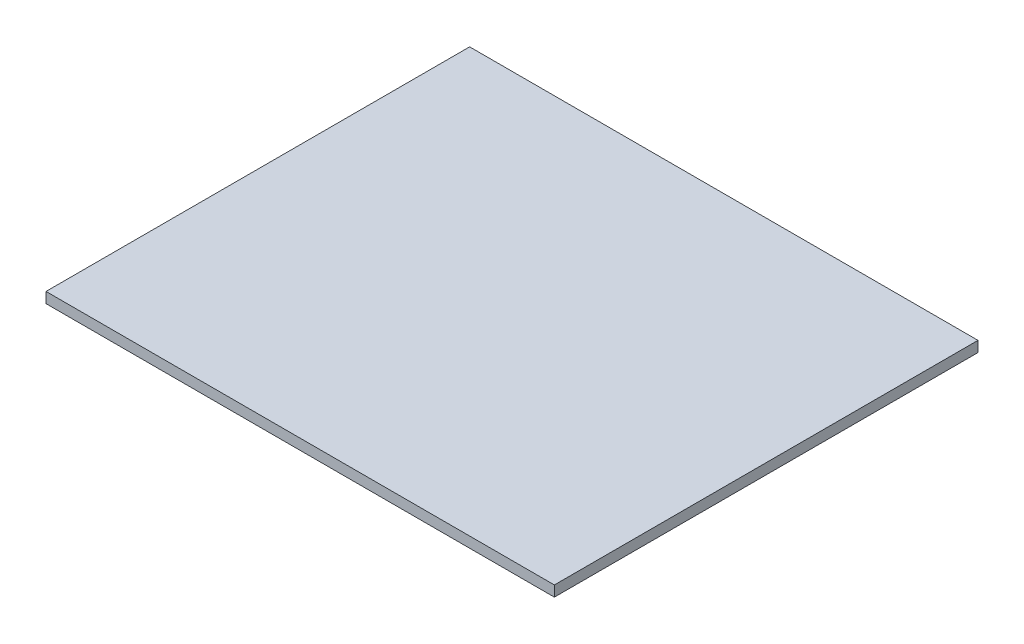
ISO-10303-21;
HEADER;
FILE_DESCRIPTION(('STEP AP214'),'2;1');
FILE_NAME('part.step','',(''),(''),'','','');
FILE_SCHEMA(('AUTOMOTIVE_DESIGN { 1 0 10303 214 1 1 1 1 }'));
ENDSEC;
DATA;
#1=APPLICATION_CONTEXT('core data for automotive mechanical design processes');
#2=APPLICATION_PROTOCOL_DEFINITION('international standard','automotive_design',2000,#1);
#3=PRODUCT_CONTEXT('',#1,'mechanical');
#4=PRODUCT('Part','Part','',(#3));
#5=PRODUCT_RELATED_PRODUCT_CATEGORY('part','',(#4));
#6=PRODUCT_DEFINITION_FORMATION('','',#4);
#7=PRODUCT_DEFINITION_CONTEXT('part definition',#1,'design');
#8=PRODUCT_DEFINITION('design','',#6,#7);
#9=PRODUCT_DEFINITION_SHAPE('','',#8);
#10=(LENGTH_UNIT() NAMED_UNIT(*) SI_UNIT(.MILLI.,.METRE.));
#11=(NAMED_UNIT(*) PLANE_ANGLE_UNIT() SI_UNIT($,.RADIAN.));
#12=(NAMED_UNIT(*) SI_UNIT($,.STERADIAN.) SOLID_ANGLE_UNIT());
#13=UNCERTAINTY_MEASURE_WITH_UNIT(LENGTH_MEASURE(1.E-05),#10,'distance_accuracy_value','');
#14=(GEOMETRIC_REPRESENTATION_CONTEXT(3) GLOBAL_UNCERTAINTY_ASSIGNED_CONTEXT((#13)) GLOBAL_UNIT_ASSIGNED_CONTEXT((#10,
#11,#12)) REPRESENTATION_CONTEXT('',''));
#15=CARTESIAN_POINT('',(0.,0.,0.));
#16=DIRECTION('',(0.,0.,1.));
#17=DIRECTION('',(1.,0.,0.));
#18=AXIS2_PLACEMENT_3D('',#15,#16,#17);
#19=CARTESIAN_POINT('',(76.2,3.175,-63.5));
#20=DIRECTION('',(-1.,0.,0.));
#21=DIRECTION('',(0.,0.,1.));
#22=AXIS2_PLACEMENT_3D('',#19,#20,#21);
#23=PLANE('',#22);
#24=DIRECTION('',(0.,0.,-1.));
#25=VECTOR('',#24,1.);
#26=CARTESIAN_POINT('',(76.2,0.,-63.5));
#27=LINE('',#26,#25);
#28=CARTESIAN_POINT('',(76.2,0.,63.5));
#29=VERTEX_POINT('',#28);
#30=CARTESIAN_POINT('',(76.2,0.,-63.5));
#31=VERTEX_POINT('',#30);
#32=EDGE_CURVE('E107',#29,#31,#27,.T.);
#33=ORIENTED_EDGE('',*,*,#32,.T.);
#34=DIRECTION('',(0.,-1.,0.));
#35=VECTOR('',#34,1.);
#36=CARTESIAN_POINT('',(76.2,3.175,-63.5));
#37=LINE('',#36,#35);
#38=CARTESIAN_POINT('',(76.2,3.175,-63.5));
#39=VERTEX_POINT('',#38);
#40=EDGE_CURVE('E11',#39,#31,#37,.T.);
#41=ORIENTED_EDGE('',*,*,#40,.F.);
#42=DIRECTION('',(0.,0.,-1.));
#43=VECTOR('',#42,1.);
#44=CARTESIAN_POINT('',(76.2,3.175,-63.5));
#45=LINE('',#44,#43);
#46=CARTESIAN_POINT('',(76.2,3.175,63.5));
#47=VERTEX_POINT('',#46);
#48=EDGE_CURVE('E91',#47,#39,#45,.T.);
#49=ORIENTED_EDGE('',*,*,#48,.F.);
#50=DIRECTION('',(0.,-1.,0.));
#51=VECTOR('',#50,1.);
#52=CARTESIAN_POINT('',(76.2,3.175,63.5));
#53=LINE('',#52,#51);
#54=EDGE_CURVE('E103',#47,#29,#53,.T.);
#55=ORIENTED_EDGE('',*,*,#54,.T.);
#56=EDGE_LOOP('',(#33,#41,#49,#55));
#57=FACE_BOUND('',#56,.T.);
#58=ADVANCED_FACE('F39',(#57),#23,.F.);
#59=CARTESIAN_POINT('',(-76.2,3.175,-63.5));
#60=DIRECTION('',(0.,0.,1.));
#61=DIRECTION('',(1.,0.,0.));
#62=AXIS2_PLACEMENT_3D('',#59,#60,#61);
#63=PLANE('',#62);
#64=DIRECTION('',(-1.,0.,0.));
#65=VECTOR('',#64,1.);
#66=CARTESIAN_POINT('',(-76.2,0.,-63.5));
#67=LINE('',#66,#65);
#68=CARTESIAN_POINT('',(-76.2,0.,-63.5));
#69=VERTEX_POINT('',#68);
#70=EDGE_CURVE('E96',#31,#69,#67,.T.);
#71=ORIENTED_EDGE('',*,*,#70,.T.);
#72=DIRECTION('',(0.,-1.,0.));
#73=VECTOR('',#72,1.);
#74=CARTESIAN_POINT('',(-76.2,3.175,-63.5));
#75=LINE('',#74,#73);
#76=CARTESIAN_POINT('',(-76.2,3.175,-63.5));
#77=VERTEX_POINT('',#76);
#78=EDGE_CURVE('E48',#77,#69,#75,.T.);
#79=ORIENTED_EDGE('',*,*,#78,.F.);
#80=DIRECTION('',(-1.,0.,0.));
#81=VECTOR('',#80,1.);
#82=CARTESIAN_POINT('',(-76.2,3.175,-63.5));
#83=LINE('',#82,#81);
#84=EDGE_CURVE('E86',#39,#77,#83,.T.);
#85=ORIENTED_EDGE('',*,*,#84,.F.);
#86=ORIENTED_EDGE('',*,*,#40,.T.);
#87=EDGE_LOOP('',(#71,#79,#85,#86));
#88=FACE_BOUND('',#87,.T.);
#89=ADVANCED_FACE('F95',(#88),#63,.F.);
#90=CARTESIAN_POINT('',(-76.2,3.175,-63.5));
#91=DIRECTION('',(1.,0.,0.));
#92=DIRECTION('',(0.,0.,-1.));
#93=AXIS2_PLACEMENT_3D('',#90,#91,#92);
#94=PLANE('',#93);
#95=DIRECTION('',(0.,0.,1.));
#96=VECTOR('',#95,1.);
#97=CARTESIAN_POINT('',(-76.2,0.,-63.5));
#98=LINE('',#97,#96);
#99=CARTESIAN_POINT('',(-76.2,0.,63.5));
#100=VERTEX_POINT('',#99);
#101=EDGE_CURVE('E73',#69,#100,#98,.T.);
#102=ORIENTED_EDGE('',*,*,#101,.T.);
#103=DIRECTION('',(0.,-1.,0.));
#104=VECTOR('',#103,1.);
#105=CARTESIAN_POINT('',(-76.2,3.175,63.5));
#106=LINE('',#105,#104);
#107=CARTESIAN_POINT('',(-76.2,3.175,63.5));
#108=VERTEX_POINT('',#107);
#109=EDGE_CURVE('E98',#108,#100,#106,.T.);
#110=ORIENTED_EDGE('',*,*,#109,.F.);
#111=DIRECTION('',(0.,0.,1.));
#112=VECTOR('',#111,1.);
#113=CARTESIAN_POINT('',(-76.2,3.175,-63.5));
#114=LINE('',#113,#112);
#115=EDGE_CURVE('E89',#77,#108,#114,.T.);
#116=ORIENTED_EDGE('',*,*,#115,.F.);
#117=ORIENTED_EDGE('',*,*,#78,.T.);
#118=EDGE_LOOP('',(#102,#110,#116,#117));
#119=FACE_BOUND('',#118,.T.);
#120=ADVANCED_FACE('F99',(#119),#94,.F.);
#121=CARTESIAN_POINT('',(-76.2,3.175,63.5));
#122=DIRECTION('',(0.,0.,-1.));
#123=DIRECTION('',(-1.,0.,0.));
#124=AXIS2_PLACEMENT_3D('',#121,#122,#123);
#125=PLANE('',#124);
#126=DIRECTION('',(1.,0.,0.));
#127=VECTOR('',#126,1.);
#128=CARTESIAN_POINT('',(-76.2,0.,63.5));
#129=LINE('',#128,#127);
#130=EDGE_CURVE('E79',#100,#29,#129,.T.);
#131=ORIENTED_EDGE('',*,*,#130,.T.);
#132=ORIENTED_EDGE('',*,*,#54,.F.);
#133=DIRECTION('',(1.,0.,0.));
#134=VECTOR('',#133,1.);
#135=CARTESIAN_POINT('',(-76.2,3.175,63.5));
#136=LINE('',#135,#134);
#137=EDGE_CURVE('E56',#108,#47,#136,.T.);
#138=ORIENTED_EDGE('',*,*,#137,.F.);
#139=ORIENTED_EDGE('',*,*,#109,.T.);
#140=EDGE_LOOP('',(#131,#132,#138,#139));
#141=FACE_BOUND('',#140,.T.);
#142=ADVANCED_FACE('F120',(#141),#125,.F.);
#143=CARTESIAN_POINT('',(0.,3.175,0.));
#144=DIRECTION('',(0.,1.,0.));
#145=DIRECTION('',(0.,0.,1.));
#146=AXIS2_PLACEMENT_3D('',#143,#144,#145);
#147=PLANE('',#146);
#148=ORIENTED_EDGE('',*,*,#48,.T.);
#149=ORIENTED_EDGE('',*,*,#84,.T.);
#150=ORIENTED_EDGE('',*,*,#115,.T.);
#151=ORIENTED_EDGE('',*,*,#137,.T.);
#152=EDGE_LOOP('',(#148,#149,#150,#151));
#153=FACE_BOUND('',#152,.T.);
#154=ADVANCED_FACE('F87',(#153),#147,.T.);
#155=CARTESIAN_POINT('',(0.,0.,0.));
#156=DIRECTION('',(0.,1.,0.));
#157=DIRECTION('',(0.,0.,1.));
#158=AXIS2_PLACEMENT_3D('',#155,#156,#157);
#159=PLANE('',#158);
#160=ORIENTED_EDGE('',*,*,#32,.F.);
#161=ORIENTED_EDGE('',*,*,#130,.F.);
#162=ORIENTED_EDGE('',*,*,#101,.F.);
#163=ORIENTED_EDGE('',*,*,#70,.F.);
#164=EDGE_LOOP('',(#160,#161,#162,#163));
#165=FACE_BOUND('',#164,.T.);
#166=ADVANCED_FACE('F123',(#165),#159,.F.);
#167=CLOSED_SHELL('',(#58,#89,#120,#142,#154,#166));
#168=MANIFOLD_SOLID_BREP('B2',#167);
#169=ADVANCED_BREP_SHAPE_REPRESENTATION('',(#18,#168),#14);
#170=SHAPE_DEFINITION_REPRESENTATION(#9,#169);
ENDSEC;
END-ISO-10303-21;
